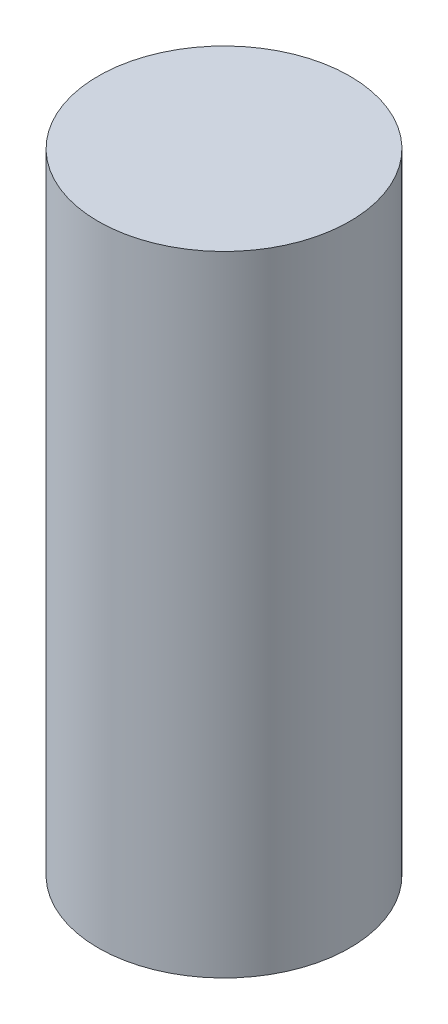
ISO-10303-21;
HEADER;
FILE_DESCRIPTION(('STEP AP214'),'2;1');
FILE_NAME('part.step','',(''),(''),'','','');
FILE_SCHEMA(('AUTOMOTIVE_DESIGN { 1 0 10303 214 1 1 1 1 }'));
ENDSEC;
DATA;
#1=APPLICATION_CONTEXT('core data for automotive mechanical design processes');
#2=APPLICATION_PROTOCOL_DEFINITION('international standard','automotive_design',2000,#1);
#3=PRODUCT_CONTEXT('',#1,'mechanical');
#4=PRODUCT('Part','Part','',(#3));
#5=PRODUCT_RELATED_PRODUCT_CATEGORY('part','',(#4));
#6=PRODUCT_DEFINITION_FORMATION('','',#4);
#7=PRODUCT_DEFINITION_CONTEXT('part definition',#1,'design');
#8=PRODUCT_DEFINITION('design','',#6,#7);
#9=PRODUCT_DEFINITION_SHAPE('','',#8);
#10=(LENGTH_UNIT() NAMED_UNIT(*) SI_UNIT(.MILLI.,.METRE.));
#11=(NAMED_UNIT(*) PLANE_ANGLE_UNIT() SI_UNIT($,.RADIAN.));
#12=(NAMED_UNIT(*) SI_UNIT($,.STERADIAN.) SOLID_ANGLE_UNIT());
#13=UNCERTAINTY_MEASURE_WITH_UNIT(LENGTH_MEASURE(1.E-05),#10,'distance_accuracy_value','');
#14=(GEOMETRIC_REPRESENTATION_CONTEXT(3) GLOBAL_UNCERTAINTY_ASSIGNED_CONTEXT((#13)) GLOBAL_UNIT_ASSIGNED_CONTEXT((#10,
#11,#12)) REPRESENTATION_CONTEXT('',''));
#15=CARTESIAN_POINT('',(0.,0.,0.));
#16=DIRECTION('',(0.,0.,1.));
#17=DIRECTION('',(1.,0.,0.));
#18=AXIS2_PLACEMENT_3D('',#15,#16,#17);
#19=CARTESIAN_POINT('',(0.,127.,0.));
#20=DIRECTION('',(0.,-1.,0.));
#21=DIRECTION('',(0.,0.,-1.));
#22=AXIS2_PLACEMENT_3D('',#19,#20,#21);
#23=CYLINDRICAL_SURFACE('',#22,25.4);
#24=CARTESIAN_POINT('',(0.,127.,0.));
#25=DIRECTION('',(0.,1.,0.));
#26=DIRECTION('',(0.,0.,1.));
#27=AXIS2_PLACEMENT_3D('',#24,#25,#26);
#28=CIRCLE('',#27,25.4);
#29=CARTESIAN_POINT('',(0.,127.,25.4));
#30=VERTEX_POINT('',#29);
#31=EDGE_CURVE('E11',#30,#30,#28,.T.);
#32=ORIENTED_EDGE('',*,*,#31,.F.);
#33=EDGE_LOOP('',(#32));
#34=FACE_BOUND('',#33,.T.);
#35=CARTESIAN_POINT('',(0.,0.,0.));
#36=DIRECTION('',(0.,1.,0.));
#37=DIRECTION('',(0.,0.,1.));
#38=AXIS2_PLACEMENT_3D('',#35,#36,#37);
#39=CIRCLE('',#38,25.4);
#40=CARTESIAN_POINT('',(0.,0.,25.4));
#41=VERTEX_POINT('',#40);
#42=EDGE_CURVE('E42',#41,#41,#39,.T.);
#43=ORIENTED_EDGE('',*,*,#42,.T.);
#44=EDGE_LOOP('',(#43));
#45=FACE_BOUND('',#44,.T.);
#46=ADVANCED_FACE('F39',(#34,#45),#23,.T.);
#47=CARTESIAN_POINT('',(0.,127.,0.));
#48=DIRECTION('',(0.,1.,0.));
#49=DIRECTION('',(0.,0.,1.));
#50=AXIS2_PLACEMENT_3D('',#47,#48,#49);
#51=PLANE('',#50);
#52=ORIENTED_EDGE('',*,*,#31,.T.);
#53=EDGE_LOOP('',(#52));
#54=FACE_BOUND('',#53,.T.);
#55=ADVANCED_FACE('F81',(#54),#51,.T.);
#56=CARTESIAN_POINT('',(0.,0.,0.));
#57=DIRECTION('',(0.,1.,0.));
#58=DIRECTION('',(0.,0.,1.));
#59=AXIS2_PLACEMENT_3D('',#56,#57,#58);
#60=PLANE('',#59);
#61=CARTESIAN_POINT('',(-12.7,0.,0.));
#62=DIRECTION('',(0.,-1.,0.));
#63=DIRECTION('',(0.,0.,-1.));
#64=AXIS2_PLACEMENT_3D('',#61,#62,#63);
#65=CIRCLE('',#64,2.5527);
#66=CARTESIAN_POINT('',(-12.7,0.,-2.5527));
#67=VERTEX_POINT('',#66);
#68=EDGE_CURVE('E63',#67,#67,#65,.T.);
#69=ORIENTED_EDGE('',*,*,#68,.F.);
#70=EDGE_LOOP('',(#69));
#71=FACE_BOUND('',#70,.T.);
#72=CARTESIAN_POINT('',(12.7,0.,0.));
#73=DIRECTION('',(0.,-1.,0.));
#74=DIRECTION('',(0.,0.,-1.));
#75=AXIS2_PLACEMENT_3D('',#72,#73,#74);
#76=CIRCLE('',#75,2.5527);
#77=CARTESIAN_POINT('',(12.7,0.,-2.55269999999999));
#78=VERTEX_POINT('',#77);
#79=EDGE_CURVE('E62',#78,#78,#76,.T.);
#80=ORIENTED_EDGE('',*,*,#79,.F.);
#81=EDGE_LOOP('',(#80));
#82=FACE_BOUND('',#81,.T.);
#83=ORIENTED_EDGE('',*,*,#42,.F.);
#84=EDGE_LOOP('',(#83));
#85=FACE_BOUND('',#84,.T.);
#86=ADVANCED_FACE('F78',(#71,#82,#85),#60,.F.);
#87=CARTESIAN_POINT('',(12.7,25.4,0.));
#88=DIRECTION('',(0.,-1.,0.));
#89=DIRECTION('',(0.,0.,-1.));
#90=AXIS2_PLACEMENT_3D('',#87,#88,#89);
#91=CONICAL_SURFACE('',#90,2.55269999999999,1.02974425867665);
#92=CARTESIAN_POINT('',(12.7,26.9338169021917,0.));
#93=VERTEX_POINT('',#92);
#94=VERTEX_LOOP('',#93);
#95=FACE_BOUND('',#94,.T.);
#96=CARTESIAN_POINT('',(12.7,25.4,0.));
#97=DIRECTION('',(0.,-1.,0.));
#98=DIRECTION('',(0.,0.,-1.));
#99=AXIS2_PLACEMENT_3D('',#96,#97,#98);
#100=CIRCLE('',#99,2.55269999999999);
#101=CARTESIAN_POINT('',(12.7,25.4,-2.55269999999999));
#102=VERTEX_POINT('',#101);
#103=EDGE_CURVE('E66',#102,#102,#100,.T.);
#104=ORIENTED_EDGE('',*,*,#103,.T.);
#105=EDGE_LOOP('',(#104));
#106=FACE_BOUND('',#105,.T.);
#107=ADVANCED_FACE('F80',(#95,#106),#91,.F.);
#108=CARTESIAN_POINT('',(12.7,0.,0.));
#109=DIRECTION('',(0.,-1.,0.));
#110=DIRECTION('',(0.,0.,-1.));
#111=AXIS2_PLACEMENT_3D('',#108,#109,#110);
#112=CYLINDRICAL_SURFACE('',#111,2.5527);
#113=ORIENTED_EDGE('',*,*,#103,.F.);
#114=EDGE_LOOP('',(#113));
#115=FACE_BOUND('',#114,.T.);
#116=ORIENTED_EDGE('',*,*,#79,.T.);
#117=EDGE_LOOP('',(#116));
#118=FACE_BOUND('',#117,.T.);
#119=ADVANCED_FACE('F56',(#115,#118),#112,.F.);
#120=CARTESIAN_POINT('',(-12.7,25.4,0.));
#121=DIRECTION('',(0.,-1.,0.));
#122=DIRECTION('',(0.,0.,-1.));
#123=AXIS2_PLACEMENT_3D('',#120,#121,#122);
#124=CONICAL_SURFACE('',#123,2.55269999999999,1.02974425867665);
#125=CARTESIAN_POINT('',(-12.7,26.9338169021917,0.));
#126=VERTEX_POINT('',#125);
#127=VERTEX_LOOP('',#126);
#128=FACE_BOUND('',#127,.T.);
#129=CARTESIAN_POINT('',(-12.7,25.4,0.));
#130=DIRECTION('',(0.,-1.,0.));
#131=DIRECTION('',(0.,0.,-1.));
#132=AXIS2_PLACEMENT_3D('',#129,#130,#131);
#133=CIRCLE('',#132,2.55269999999999);
#134=CARTESIAN_POINT('',(-12.7,25.4,-2.5527));
#135=VERTEX_POINT('',#134);
#136=EDGE_CURVE('E60',#135,#135,#133,.T.);
#137=ORIENTED_EDGE('',*,*,#136,.T.);
#138=EDGE_LOOP('',(#137));
#139=FACE_BOUND('',#138,.T.);
#140=ADVANCED_FACE('F52',(#128,#139),#124,.F.);
#141=CARTESIAN_POINT('',(-12.7,0.,0.));
#142=DIRECTION('',(0.,-1.,0.));
#143=DIRECTION('',(0.,0.,-1.));
#144=AXIS2_PLACEMENT_3D('',#141,#142,#143);
#145=CYLINDRICAL_SURFACE('',#144,2.5527);
#146=ORIENTED_EDGE('',*,*,#136,.F.);
#147=EDGE_LOOP('',(#146));
#148=FACE_BOUND('',#147,.T.);
#149=ORIENTED_EDGE('',*,*,#68,.T.);
#150=EDGE_LOOP('',(#149));
#151=FACE_BOUND('',#150,.T.);
#152=ADVANCED_FACE('F55',(#148,#151),#145,.F.);
#153=CLOSED_SHELL('',(#46,#55,#86,#107,#119,#140,#152));
#154=MANIFOLD_SOLID_BREP('B2',#153);
#155=ADVANCED_BREP_SHAPE_REPRESENTATION('',(#18,#154),#14);
#156=SHAPE_DEFINITION_REPRESENTATION(#9,#155);
ENDSEC;
END-ISO-10303-21;
